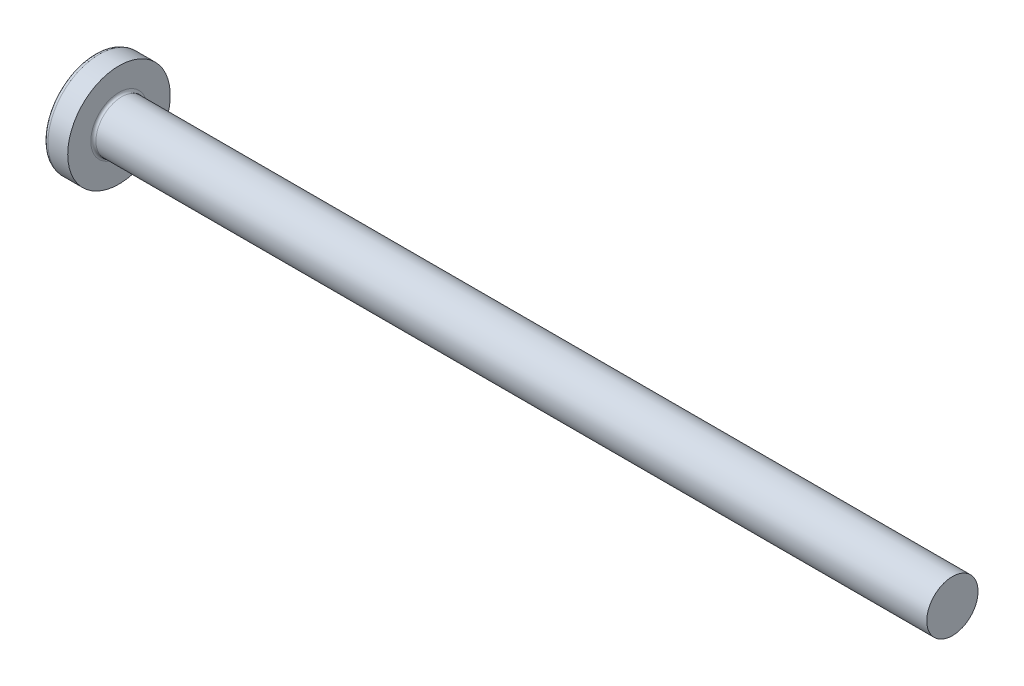
ISO-10303-21;
HEADER;
FILE_DESCRIPTION(('STEP AP214'),'2;1');
FILE_NAME('part.step','',(''),(''),'','','');
FILE_SCHEMA(('AUTOMOTIVE_DESIGN { 1 0 10303 214 1 1 1 1 }'));
ENDSEC;
DATA;
#1=APPLICATION_CONTEXT('core data for automotive mechanical design processes');
#2=APPLICATION_PROTOCOL_DEFINITION('international standard','automotive_design',2000,#1);
#3=PRODUCT_CONTEXT('',#1,'mechanical');
#4=PRODUCT('Part','Part','',(#3));
#5=PRODUCT_RELATED_PRODUCT_CATEGORY('part','',(#4));
#6=PRODUCT_DEFINITION_FORMATION('','',#4);
#7=PRODUCT_DEFINITION_CONTEXT('part definition',#1,'design');
#8=PRODUCT_DEFINITION('design','',#6,#7);
#9=PRODUCT_DEFINITION_SHAPE('','',#8);
#10=(LENGTH_UNIT() NAMED_UNIT(*) SI_UNIT(.MILLI.,.METRE.));
#11=(NAMED_UNIT(*) PLANE_ANGLE_UNIT() SI_UNIT($,.RADIAN.));
#12=(NAMED_UNIT(*) SI_UNIT($,.STERADIAN.) SOLID_ANGLE_UNIT());
#13=UNCERTAINTY_MEASURE_WITH_UNIT(LENGTH_MEASURE(1.E-05),#10,'distance_accuracy_value','');
#14=(GEOMETRIC_REPRESENTATION_CONTEXT(3) GLOBAL_UNCERTAINTY_ASSIGNED_CONTEXT((#13)) GLOBAL_UNIT_ASSIGNED_CONTEXT((#10,
#11,#12)) REPRESENTATION_CONTEXT('',''));
#15=CARTESIAN_POINT('',(0.,0.,0.));
#16=DIRECTION('',(0.,0.,1.));
#17=DIRECTION('',(1.,0.,0.));
#18=AXIS2_PLACEMENT_3D('',#15,#16,#17);
#19=CARTESIAN_POINT('',(6.5,0.,0.));
#20=DIRECTION('',(-1.,0.,0.));
#21=DIRECTION('',(0.,1.,0.));
#22=AXIS2_PLACEMENT_3D('',#19,#20,#21);
#23=SPHERICAL_SURFACE('',#22,6.5);
#24=CARTESIAN_POINT('',(1.26538895452803,0.,0.));
#25=DIRECTION('',(-1.,0.,0.));
#26=DIRECTION('',(0.,0.,1.));
#27=AXIS2_PLACEMENT_3D('',#24,#25,#26);
#28=CIRCLE('',#27,3.85342019543974);
#29=CARTESIAN_POINT('',(1.26538895452803,0.,3.85342019543974));
#30=VERTEX_POINT('',#29);
#31=EDGE_CURVE('E222',#30,#30,#28,.T.);
#32=ORIENTED_EDGE('',*,*,#31,.T.);
#33=EDGE_LOOP('',(#32));
#34=FACE_BOUND('',#33,.T.);
#35=CARTESIAN_POINT('',(0.0788099820016241,0.,0.));
#36=DIRECTION('',(1.,0.,0.));
#37=DIRECTION('',(0.,0.,-1.));
#38=AXIS2_PLACEMENT_3D('',#35,#36,#37);
#39=CIRCLE('',#38,1.0091178091571);
#40=CARTESIAN_POINT('',(0.0788099820016233,-0.514999999999997,-0.867809744562728));
#41=VERTEX_POINT('',#40);
#42=CARTESIAN_POINT('',(0.0788099820016245,-0.867809744562729,-0.515));
#43=VERTEX_POINT('',#42);
#44=EDGE_CURVE('E381',#41,#43,#39,.F.);
#45=ORIENTED_EDGE('',*,*,#44,.F.);
#46=CARTESIAN_POINT('',(6.5,-0.515,0.));
#47=DIRECTION('',(0.,1.,0.));
#48=DIRECTION('',(0.,0.,1.));
#49=AXIS2_PLACEMENT_3D('',#46,#47,#48);
#50=CIRCLE('',#49,6.47956595768575);
#51=CARTESIAN_POINT('',(0.331830520157853,-0.514999999999993,-1.98455543332603));
#52=VERTEX_POINT('',#51);
#53=EDGE_CURVE('E297',#52,#41,#50,.T.);
#54=ORIENTED_EDGE('',*,*,#53,.F.);
#55=CARTESIAN_POINT('',(6.06443225879603,0.,0.873613881878153));
#56=DIRECTION('',(0.446197753347436,0.,-0.894934391398443));
#57=DIRECTION('',(-0.894934391398442,0.,-0.446197753347436));
#58=AXIS2_PLACEMENT_3D('',#55,#56,#57);
#59=CIRCLE('',#58,6.42628038045433);
#60=CARTESIAN_POINT('',(0.331830520157853,0.515000000000007,-1.98455543332603));
#61=VERTEX_POINT('',#60);
#62=EDGE_CURVE('E266',#52,#61,#59,.T.);
#63=ORIENTED_EDGE('',*,*,#62,.T.);
#64=CARTESIAN_POINT('',(6.5,0.515,0.));
#65=DIRECTION('',(0.,-1.,0.));
#66=DIRECTION('',(0.,0.,-1.));
#67=AXIS2_PLACEMENT_3D('',#64,#65,#66);
#68=CIRCLE('',#67,6.47956595768575);
#69=CARTESIAN_POINT('',(0.0788099820016234,0.515000000000003,-0.867809744562724));
#70=VERTEX_POINT('',#69);
#71=EDGE_CURVE('E333',#70,#61,#68,.T.);
#72=ORIENTED_EDGE('',*,*,#71,.F.);
#73=CARTESIAN_POINT('',(0.0788099820016245,0.86780974456273,-0.515));
#74=VERTEX_POINT('',#73);
#75=EDGE_CURVE('E402',#74,#70,#39,.F.);
#76=ORIENTED_EDGE('',*,*,#75,.F.);
#77=CARTESIAN_POINT('',(6.5,0.,-0.515));
#78=DIRECTION('',(0.,0.,1.));
#79=DIRECTION('',(1.,0.,0.));
#80=AXIS2_PLACEMENT_3D('',#77,#78,#79);
#81=CIRCLE('',#80,6.47956595768575);
#82=CARTESIAN_POINT('',(0.331830520157854,1.98455543332603,-0.515));
#83=VERTEX_POINT('',#82);
#84=EDGE_CURVE('E258',#83,#74,#81,.T.);
#85=ORIENTED_EDGE('',*,*,#84,.F.);
#86=CARTESIAN_POINT('',(6.06443225879603,-0.873613881878153,0.));
#87=DIRECTION('',(0.446197753347436,0.894934391398443,0.));
#88=DIRECTION('',(-0.894934391398442,0.446197753347436,0.));
#89=AXIS2_PLACEMENT_3D('',#86,#87,#88);
#90=CIRCLE('',#89,6.42628038045433);
#91=CARTESIAN_POINT('',(0.331830520157854,1.98455543332603,0.515));
#92=VERTEX_POINT('',#91);
#93=EDGE_CURVE('E262',#83,#92,#90,.T.);
#94=ORIENTED_EDGE('',*,*,#93,.T.);
#95=CARTESIAN_POINT('',(6.5,0.,0.515));
#96=DIRECTION('',(0.,0.,-1.));
#97=DIRECTION('',(0.,1.,0.));
#98=AXIS2_PLACEMENT_3D('',#95,#96,#97);
#99=CIRCLE('',#98,6.47956595768575);
#100=CARTESIAN_POINT('',(0.0788099820016245,0.86780974456273,0.515));
#101=VERTEX_POINT('',#100);
#102=EDGE_CURVE('E253',#101,#92,#99,.T.);
#103=ORIENTED_EDGE('',*,*,#102,.F.);
#104=CARTESIAN_POINT('',(0.0788099820016232,0.514999999999997,0.867809744562728));
#105=VERTEX_POINT('',#104);
#106=EDGE_CURVE('E401',#105,#101,#39,.F.);
#107=ORIENTED_EDGE('',*,*,#106,.F.);
#108=CARTESIAN_POINT('',(0.331830520157854,0.514999999999993,1.98455543332604));
#109=VERTEX_POINT('',#108);
#110=EDGE_CURVE('E278',#109,#105,#68,.T.);
#111=ORIENTED_EDGE('',*,*,#110,.F.);
#112=CARTESIAN_POINT('',(6.06443225879603,0.,-0.873613881878153));
#113=DIRECTION('',(0.446197753347436,0.,0.894934391398443));
#114=DIRECTION('',(0.894934391398442,0.,-0.446197753347436));
#115=AXIS2_PLACEMENT_3D('',#112,#113,#114);
#116=CIRCLE('',#115,6.42628038045433);
#117=CARTESIAN_POINT('',(0.331830520157854,-0.515000000000007,1.98455543332603));
#118=VERTEX_POINT('',#117);
#119=EDGE_CURVE('E56',#109,#118,#116,.T.);
#120=ORIENTED_EDGE('',*,*,#119,.T.);
#121=CARTESIAN_POINT('',(0.0788099820016234,-0.515000000000003,0.867809744562724));
#122=VERTEX_POINT('',#121);
#123=EDGE_CURVE('E275',#122,#118,#50,.T.);
#124=ORIENTED_EDGE('',*,*,#123,.F.);
#125=CARTESIAN_POINT('',(0.0788099820016245,-0.867809744562729,0.515));
#126=VERTEX_POINT('',#125);
#127=EDGE_CURVE('E440',#126,#122,#39,.F.);
#128=ORIENTED_EDGE('',*,*,#127,.F.);
#129=CARTESIAN_POINT('',(0.331830520157854,-1.98455543332603,0.515));
#130=VERTEX_POINT('',#129);
#131=EDGE_CURVE('E254',#130,#126,#99,.T.);
#132=ORIENTED_EDGE('',*,*,#131,.F.);
#133=CARTESIAN_POINT('',(6.06443225879604,0.873613881878153,0.));
#134=DIRECTION('',(0.446197753347436,-0.894934391398443,0.));
#135=DIRECTION('',(0.894934391398442,0.446197753347436,0.));
#136=AXIS2_PLACEMENT_3D('',#133,#134,#135);
#137=CIRCLE('',#136,6.42628038045433);
#138=CARTESIAN_POINT('',(0.331830520157854,-1.98455543332603,-0.515));
#139=VERTEX_POINT('',#138);
#140=EDGE_CURVE('E249',#130,#139,#137,.T.);
#141=ORIENTED_EDGE('',*,*,#140,.T.);
#142=EDGE_CURVE('E71',#43,#139,#81,.T.);
#143=ORIENTED_EDGE('',*,*,#142,.F.);
#144=EDGE_LOOP('',(#45,#54,#63,#72,#76,#85,#94,#103,#107,#111,#120,#124,#128,#132,#141,#143));
#145=FACE_BOUND('',#144,.T.);
#146=ADVANCED_FACE('F41',(#34,#145),#23,.T.);
#147=CARTESIAN_POINT('',(0.,2.15,-0.515));
#148=DIRECTION('',(0.,0.,1.));
#149=DIRECTION('',(1.,0.,0.));
#150=AXIS2_PLACEMENT_3D('',#147,#148,#149);
#151=PLANE('',#150);
#152=ORIENTED_EDGE('',*,*,#84,.T.);
#153=CARTESIAN_POINT('',(-1.51195208675156,0.994972220320188,-0.515));
#154=CARTESIAN_POINT('',(-1.2040598194928,0.970722016949958,-0.515));
#155=CARTESIAN_POINT('',(-0.896180907521175,0.946299109919651,-0.515));
#156=CARTESIAN_POINT('',(-0.280449079832186,0.896981122427851,-0.515));
#157=CARTESIAN_POINT('',(0.0274038344396859,0.872086023934883,-0.515));
#158=CARTESIAN_POINT('',(0.48914673951535,0.83429553519528,-0.515));
#159=CARTESIAN_POINT('',(0.643055047553845,0.821624058404092,-0.515));
#160=CARTESIAN_POINT('',(0.950856520197139,0.796108332639504,-0.515));
#161=CARTESIAN_POINT('',(1.10474968487868,0.783264084592466,-0.515));
#162=CARTESIAN_POINT('',(1.41251352095103,0.757376569093378,-0.515));
#163=CARTESIAN_POINT('',(1.56638419296577,0.744333309065218,-0.515));
#164=CARTESIAN_POINT('',(1.87410847343335,0.718013273188896,-0.515));
#165=CARTESIAN_POINT('',(2.02796208151372,0.704736492982792,-0.515));
#166=CARTESIAN_POINT('',(2.36455311890989,0.675386943006726,-0.515));
#167=CARTESIAN_POINT('',(2.54728562293342,0.659257575640986,-0.515));
#168=CARTESIAN_POINT('',(2.91270624109256,0.626517182479888,-0.515));
#169=CARTESIAN_POINT('',(3.09539435554038,0.609906160177238,-0.515));
#170=CARTESIAN_POINT('',(3.46069832191613,0.576073027116421,-0.515));
#171=CARTESIAN_POINT('',(3.64331417870068,0.558850968932727,-0.515));
#172=CARTESIAN_POINT('',(4.00847437496567,0.523604864540037,-0.515));
#173=CARTESIAN_POINT('',(4.19101871216888,0.505580794604253,-0.515));
#174=CARTESIAN_POINT('',(4.55606208157937,0.468429191666488,-0.515));
#175=CARTESIAN_POINT('',(4.73856107358023,0.449301262281853,-0.515));
#176=CARTESIAN_POINT('',(5.10337547353419,0.409473604748924,-0.515));
#177=CARTESIAN_POINT('',(5.28569089526422,0.388774005106069,-0.515));
#178=CARTESIAN_POINT('',(5.55897278495412,0.355828287527264,-0.515));
#179=CARTESIAN_POINT('',(5.65005277419686,0.344527918782738,-0.515));
#180=CARTESIAN_POINT('',(5.83209904103608,0.321075174263031,-0.515));
#181=CARTESIAN_POINT('',(5.92306532397915,0.308922840209686,-0.515));
#182=CARTESIAN_POINT('',(6.10486078872898,0.28342733445193,-0.515));
#183=CARTESIAN_POINT('',(6.1956899229938,0.270083817601714,-0.515));
#184=CARTESIAN_POINT('',(6.33172773785679,0.248701420809951,-0.515));
#185=CARTESIAN_POINT('',(6.37704304473344,0.241345446705304,-0.515));
#186=CARTESIAN_POINT('',(6.4675722520141,0.226018953559338,-0.515));
#187=CARTESIAN_POINT('',(6.51278614568083,0.218048394864476,-0.515));
#188=CARTESIAN_POINT('',(6.55793125759549,0.209691465274944,-0.515));
#189=B_SPLINE_CURVE_WITH_KNOTS('',3,(#153,#154,#155,#156,#157,#158,#159,#160,#161,#162,#163,
#164,#165,#166,#167,#168,#169,#170,#171,#172,#173,#174,#175,#176,#177,#178,#179,#180,#181,#182,
#183,#184,#185,#186,#187,#188),.UNSPECIFIED.,.F.,.F.,(4,2,2,2,2,2,2,2,2,2,2,2,2,2,2,2,2,4),(0.,
0.926537709781721,1.85311087258339,2.31639796016285,2.77968256468771,3.24294992902055,
3.70622594801777,4.25655436065378,4.80687878359543,5.35715597005738,5.90744944680718,
6.45794177197673,7.008389135274,7.28372117336899,7.55903973750591,7.83443833587749,
7.97216007460855,8.10989070671571),.UNSPECIFIED.);
#190=CARTESIAN_POINT('',(2.34,0.677477674908923,-0.515));
#191=VERTEX_POINT('',#190);
#192=EDGE_CURVE('E425',#74,#191,#189,.T.);
#193=ORIENTED_EDGE('',*,*,#192,.T.);
#194=DIRECTION('',(0.,1.,0.));
#195=VECTOR('',#194,1.);
#196=CARTESIAN_POINT('',(2.34,-0.983319232260742,-0.515));
#197=LINE('',#196,#195);
#198=CARTESIAN_POINT('',(2.34,0.983319232260743,-0.515));
#199=VERTEX_POINT('',#198);
#200=EDGE_CURVE('E362',#191,#199,#197,.T.);
#201=ORIENTED_EDGE('',*,*,#200,.T.);
#202=DIRECTION('',(0.894934391398442,-0.446197753347436,0.));
#203=VECTOR('',#202,1.);
#204=CARTESIAN_POINT('',(0.,2.15,-0.515));
#205=LINE('',#204,#203);
#206=EDGE_CURVE('E223',#83,#199,#205,.T.);
#207=ORIENTED_EDGE('',*,*,#206,.F.);
#208=EDGE_LOOP('',(#152,#193,#201,#207));
#209=FACE_BOUND('',#208,.T.);
#210=ADVANCED_FACE('F177',(#209),#151,.T.);
#211=CARTESIAN_POINT('',(2.34,-0.983319232260742,-0.515));
#212=VERTEX_POINT('',#211);
#213=CARTESIAN_POINT('',(2.34,-0.677477674908923,-0.515));
#214=VERTEX_POINT('',#213);
#215=EDGE_CURVE('E233',#212,#214,#197,.T.);
#216=ORIENTED_EDGE('',*,*,#215,.T.);
#217=CARTESIAN_POINT('',(-1.51195208675156,-0.994972220320188,-0.515));
#218=CARTESIAN_POINT('',(-1.2040598194928,-0.970722016949958,-0.515));
#219=CARTESIAN_POINT('',(-0.896180907521175,-0.946299109919651,-0.515));
#220=CARTESIAN_POINT('',(-0.280449079832186,-0.896981122427851,-0.515));
#221=CARTESIAN_POINT('',(0.0274038344396859,-0.872086023934883,-0.515));
#222=CARTESIAN_POINT('',(0.489146739515349,-0.83429553519528,-0.515));
#223=CARTESIAN_POINT('',(0.643055047553845,-0.821624058404092,-0.515));
#224=CARTESIAN_POINT('',(0.950856520197139,-0.796108332639504,-0.515));
#225=CARTESIAN_POINT('',(1.10474968487868,-0.783264084592466,-0.515));
#226=CARTESIAN_POINT('',(1.41251352095103,-0.757376569093378,-0.515));
#227=CARTESIAN_POINT('',(1.56638419296577,-0.744333309065218,-0.515));
#228=CARTESIAN_POINT('',(1.87410847343335,-0.718013273188896,-0.515));
#229=CARTESIAN_POINT('',(2.02796208151372,-0.704736492982792,-0.515));
#230=CARTESIAN_POINT('',(2.36455311890989,-0.675386943006726,-0.515));
#231=CARTESIAN_POINT('',(2.54728562293342,-0.659257575640986,-0.515));
#232=CARTESIAN_POINT('',(2.91270624109256,-0.626517182479888,-0.515));
#233=CARTESIAN_POINT('',(3.09539435554038,-0.609906160177238,-0.515));
#234=CARTESIAN_POINT('',(3.46069832191613,-0.576073027116421,-0.515));
#235=CARTESIAN_POINT('',(3.64331417870068,-0.558850968932727,-0.515));
#236=CARTESIAN_POINT('',(4.00847437496567,-0.523604864540037,-0.515));
#237=CARTESIAN_POINT('',(4.19101871216888,-0.505580794604253,-0.515));
#238=CARTESIAN_POINT('',(4.55606208157937,-0.468429191666488,-0.515));
#239=CARTESIAN_POINT('',(4.73856107358023,-0.449301262281853,-0.515));
#240=CARTESIAN_POINT('',(5.10337547353419,-0.409473604748924,-0.515));
#241=CARTESIAN_POINT('',(5.28569089526422,-0.388774005106069,-0.515));
#242=CARTESIAN_POINT('',(5.55897278495412,-0.355828287527264,-0.515));
#243=CARTESIAN_POINT('',(5.65005277419686,-0.344527918782738,-0.515));
#244=CARTESIAN_POINT('',(5.83209904103608,-0.321075174263031,-0.515));
#245=CARTESIAN_POINT('',(5.92306532397915,-0.308922840209686,-0.515));
#246=CARTESIAN_POINT('',(6.10486078872898,-0.28342733445193,-0.515));
#247=CARTESIAN_POINT('',(6.1956899229938,-0.270083817601714,-0.515));
#248=CARTESIAN_POINT('',(6.3317277378568,-0.24870142080995,-0.515));
#249=CARTESIAN_POINT('',(6.37704304473344,-0.241345446705304,-0.515));
#250=CARTESIAN_POINT('',(6.4675722520141,-0.226018953559337,-0.515));
#251=CARTESIAN_POINT('',(6.51278614568083,-0.218048394864476,-0.515));
#252=CARTESIAN_POINT('',(6.55793125759549,-0.209691465274944,-0.515));
#253=B_SPLINE_CURVE_WITH_KNOTS('',3,(#217,#218,#219,#220,#221,#222,#223,#224,#225,#226,#227,
#228,#229,#230,#231,#232,#233,#234,#235,#236,#237,#238,#239,#240,#241,#242,#243,#244,#245,#246,
#247,#248,#249,#250,#251,#252),.UNSPECIFIED.,.F.,.F.,(4,2,2,2,2,2,2,2,2,2,2,2,2,2,2,2,2,4),(0.,
0.926537709781721,1.85311087258339,2.31639796016285,2.77968256468771,3.24294992902055,
3.70622594801777,4.25655436065378,4.80687878359543,5.35715597005738,5.90744944680718,
6.45794177197674,7.008389135274,7.28372117336899,7.55903973750591,7.83443833587749,
7.97216007460855,8.10989070671572),.UNSPECIFIED.);
#254=EDGE_CURVE('E400',#214,#43,#253,.F.);
#255=ORIENTED_EDGE('',*,*,#254,.T.);
#256=ORIENTED_EDGE('',*,*,#142,.T.);
#257=DIRECTION('',(0.894934391398442,0.446197753347436,0.));
#258=VECTOR('',#257,1.);
#259=CARTESIAN_POINT('',(0.,-2.15,-0.515));
#260=LINE('',#259,#258);
#261=EDGE_CURVE('E337',#139,#212,#260,.T.);
#262=ORIENTED_EDGE('',*,*,#261,.T.);
#263=EDGE_LOOP('',(#216,#255,#256,#262));
#264=FACE_BOUND('',#263,.T.);
#265=ADVANCED_FACE('F183',(#264),#151,.T.);
#266=CARTESIAN_POINT('',(0.,-2.15,0.515));
#267=DIRECTION('',(0.,0.,-1.));
#268=DIRECTION('',(0.,1.,0.));
#269=AXIS2_PLACEMENT_3D('',#266,#267,#268);
#270=PLANE('',#269);
#271=DIRECTION('',(0.,-1.,0.));
#272=VECTOR('',#271,1.);
#273=CARTESIAN_POINT('',(2.34,0.983319232260742,0.515));
#274=LINE('',#273,#272);
#275=CARTESIAN_POINT('',(2.34,0.983319232260743,0.515));
#276=VERTEX_POINT('',#275);
#277=CARTESIAN_POINT('',(2.34,0.677477674908923,0.515));
#278=VERTEX_POINT('',#277);
#279=EDGE_CURVE('E348',#276,#278,#274,.T.);
#280=ORIENTED_EDGE('',*,*,#279,.T.);
#281=CARTESIAN_POINT('',(-1.51195208675156,0.994972220320187,0.515));
#282=CARTESIAN_POINT('',(-1.2040598194928,0.970722016949958,0.515));
#283=CARTESIAN_POINT('',(-0.896180907521175,0.946299109919651,0.515));
#284=CARTESIAN_POINT('',(-0.280449079832187,0.896981122427851,0.515));
#285=CARTESIAN_POINT('',(0.0274038344396859,0.872086023934883,0.515));
#286=CARTESIAN_POINT('',(0.489146739515349,0.83429553519528,0.515));
#287=CARTESIAN_POINT('',(0.643055047553845,0.821624058404092,0.515));
#288=CARTESIAN_POINT('',(0.950856520197139,0.796108332639504,0.515));
#289=CARTESIAN_POINT('',(1.10474968487868,0.783264084592466,0.515));
#290=CARTESIAN_POINT('',(1.41251352095103,0.757376569093378,0.515));
#291=CARTESIAN_POINT('',(1.56638419296577,0.744333309065218,0.515));
#292=CARTESIAN_POINT('',(1.87410847343335,0.718013273188896,0.515));
#293=CARTESIAN_POINT('',(2.02796208151372,0.704736492982792,0.515));
#294=CARTESIAN_POINT('',(2.36455311890989,0.675386943006726,0.515));
#295=CARTESIAN_POINT('',(2.54728562293342,0.659257575640986,0.515));
#296=CARTESIAN_POINT('',(2.91270624109256,0.626517182479888,0.515));
#297=CARTESIAN_POINT('',(3.09539435554038,0.609906160177238,0.515));
#298=CARTESIAN_POINT('',(3.46069832191612,0.576073027116421,0.515));
#299=CARTESIAN_POINT('',(3.64331417870068,0.558850968932727,0.515));
#300=CARTESIAN_POINT('',(4.00847437496567,0.523604864540037,0.515));
#301=CARTESIAN_POINT('',(4.19101871216888,0.505580794604253,0.515));
#302=CARTESIAN_POINT('',(4.55606208157937,0.468429191666488,0.515));
#303=CARTESIAN_POINT('',(4.73856107358022,0.449301262281854,0.515));
#304=CARTESIAN_POINT('',(5.10337547353418,0.409473604748925,0.515));
#305=CARTESIAN_POINT('',(5.28569089526422,0.38877400510607,0.515));
#306=CARTESIAN_POINT('',(5.55897278495412,0.355828287527264,0.515));
#307=CARTESIAN_POINT('',(5.65005277419686,0.344527918782739,0.515));
#308=CARTESIAN_POINT('',(5.83209904103607,0.321075174263031,0.515));
#309=CARTESIAN_POINT('',(5.92306532397915,0.308922840209686,0.515));
#310=CARTESIAN_POINT('',(6.10486078872898,0.28342733445193,0.515));
#311=CARTESIAN_POINT('',(6.1956899229938,0.270083817601714,0.515));
#312=CARTESIAN_POINT('',(6.33172773785679,0.248701420809951,0.515));
#313=CARTESIAN_POINT('',(6.37704304473344,0.241345446705304,0.515));
#314=CARTESIAN_POINT('',(6.4675722520141,0.226018953559338,0.515));
#315=CARTESIAN_POINT('',(6.51278614568083,0.218048394864476,0.515));
#316=CARTESIAN_POINT('',(6.55793125759549,0.209691465274945,0.515));
#317=B_SPLINE_CURVE_WITH_KNOTS('',3,(#281,#282,#283,#284,#285,#286,#287,#288,#289,#290,#291,
#292,#293,#294,#295,#296,#297,#298,#299,#300,#301,#302,#303,#304,#305,#306,#307,#308,#309,#310,
#311,#312,#313,#314,#315,#316),.UNSPECIFIED.,.F.,.F.,(4,2,2,2,2,2,2,2,2,2,2,2,2,2,2,2,2,4),(0.,
0.926537709781721,1.85311087258339,2.31639796016285,2.77968256468771,3.24294992902055,
3.70622594801777,4.25655436065378,4.80687878359543,5.35715597005738,5.90744944680718,
6.45794177197673,7.008389135274,7.28372117336899,7.55903973750591,7.83443833587749,
7.97216007460855,8.10989070671571),.UNSPECIFIED.);
#318=EDGE_CURVE('E302',#278,#101,#317,.F.);
#319=ORIENTED_EDGE('',*,*,#318,.T.);
#320=ORIENTED_EDGE('',*,*,#102,.T.);
#321=DIRECTION('',(0.894934391398442,-0.446197753347436,0.));
#322=VECTOR('',#321,1.);
#323=CARTESIAN_POINT('',(0.,2.15,0.515));
#324=LINE('',#323,#322);
#325=EDGE_CURVE('E230',#92,#276,#324,.T.);
#326=ORIENTED_EDGE('',*,*,#325,.T.);
#327=EDGE_LOOP('',(#280,#319,#320,#326));
#328=FACE_BOUND('',#327,.T.);
#329=ADVANCED_FACE('F421',(#328),#270,.T.);
#330=ORIENTED_EDGE('',*,*,#131,.T.);
#331=CARTESIAN_POINT('',(-1.51195208675156,-0.994972220320188,0.515));
#332=CARTESIAN_POINT('',(-1.2040598194928,-0.970722016949958,0.515));
#333=CARTESIAN_POINT('',(-0.896180907521175,-0.946299109919651,0.515));
#334=CARTESIAN_POINT('',(-0.280449079832186,-0.896981122427852,0.515));
#335=CARTESIAN_POINT('',(0.0274038344396859,-0.872086023934883,0.515));
#336=CARTESIAN_POINT('',(0.48914673951535,-0.83429553519528,0.515));
#337=CARTESIAN_POINT('',(0.643055047553845,-0.821624058404092,0.515));
#338=CARTESIAN_POINT('',(0.950856520197139,-0.796108332639504,0.515));
#339=CARTESIAN_POINT('',(1.10474968487868,-0.783264084592466,0.515));
#340=CARTESIAN_POINT('',(1.41251352095103,-0.757376569093379,0.515));
#341=CARTESIAN_POINT('',(1.56638419296577,-0.744333309065218,0.515));
#342=CARTESIAN_POINT('',(1.87410847343335,-0.718013273188896,0.515));
#343=CARTESIAN_POINT('',(2.02796208151372,-0.704736492982792,0.515));
#344=CARTESIAN_POINT('',(2.36455311890989,-0.675386943006726,0.515));
#345=CARTESIAN_POINT('',(2.54728562293342,-0.659257575640986,0.515));
#346=CARTESIAN_POINT('',(2.91270624109256,-0.626517182479888,0.515));
#347=CARTESIAN_POINT('',(3.09539435554038,-0.609906160177238,0.515));
#348=CARTESIAN_POINT('',(3.46069832191613,-0.576073027116422,0.515));
#349=CARTESIAN_POINT('',(3.64331417870068,-0.558850968932728,0.515));
#350=CARTESIAN_POINT('',(4.00847437496567,-0.523604864540037,0.515));
#351=CARTESIAN_POINT('',(4.19101871216888,-0.505580794604253,0.515));
#352=CARTESIAN_POINT('',(4.55606208157937,-0.468429191666488,0.515));
#353=CARTESIAN_POINT('',(4.73856107358023,-0.449301262281854,0.515));
#354=CARTESIAN_POINT('',(5.10337547353419,-0.409473604748924,0.515));
#355=CARTESIAN_POINT('',(5.28569089526422,-0.38877400510607,0.515));
#356=CARTESIAN_POINT('',(5.55897278495412,-0.355828287527264,0.515));
#357=CARTESIAN_POINT('',(5.65005277419686,-0.344527918782739,0.515));
#358=CARTESIAN_POINT('',(5.83209904103608,-0.321075174263031,0.515));
#359=CARTESIAN_POINT('',(5.92306532397915,-0.308922840209686,0.515));
#360=CARTESIAN_POINT('',(6.10486078872898,-0.28342733445193,0.515));
#361=CARTESIAN_POINT('',(6.1956899229938,-0.270083817601714,0.515));
#362=CARTESIAN_POINT('',(6.33172773785679,-0.248701420809951,0.515));
#363=CARTESIAN_POINT('',(6.37704304473344,-0.241345446705304,0.515));
#364=CARTESIAN_POINT('',(6.4675722520141,-0.226018953559338,0.515));
#365=CARTESIAN_POINT('',(6.51278614568083,-0.218048394864477,0.515));
#366=CARTESIAN_POINT('',(6.55793125759549,-0.209691465274945,0.515));
#367=B_SPLINE_CURVE_WITH_KNOTS('',3,(#331,#332,#333,#334,#335,#336,#337,#338,#339,#340,#341,
#342,#343,#344,#345,#346,#347,#348,#349,#350,#351,#352,#353,#354,#355,#356,#357,#358,#359,#360,
#361,#362,#363,#364,#365,#366),.UNSPECIFIED.,.F.,.F.,(4,2,2,2,2,2,2,2,2,2,2,2,2,2,2,2,2,4),(0.,
0.926537709781721,1.85311087258339,2.31639796016285,2.77968256468771,3.24294992902055,
3.70622594801777,4.25655436065378,4.80687878359543,5.35715597005738,5.90744944680718,
6.45794177197673,7.008389135274,7.28372117336899,7.55903973750591,7.83443833587749,
7.97216007460855,8.10989070671571),.UNSPECIFIED.);
#368=CARTESIAN_POINT('',(2.34,-0.677477674908923,0.515));
#369=VERTEX_POINT('',#368);
#370=EDGE_CURVE('E441',#126,#369,#367,.T.);
#371=ORIENTED_EDGE('',*,*,#370,.T.);
#372=CARTESIAN_POINT('',(2.34,-0.983319232260742,0.515));
#373=VERTEX_POINT('',#372);
#374=EDGE_CURVE('E351',#369,#373,#274,.T.);
#375=ORIENTED_EDGE('',*,*,#374,.T.);
#376=DIRECTION('',(0.894934391398442,0.446197753347436,0.));
#377=VECTOR('',#376,1.);
#378=CARTESIAN_POINT('',(0.,-2.15,0.515));
#379=LINE('',#378,#377);
#380=EDGE_CURVE('E340',#130,#373,#379,.T.);
#381=ORIENTED_EDGE('',*,*,#380,.F.);
#382=EDGE_LOOP('',(#330,#371,#375,#381));
#383=FACE_BOUND('',#382,.T.);
#384=ADVANCED_FACE('F471',(#383),#270,.T.);
#385=CARTESIAN_POINT('',(2.34,0.983319232260742,-0.515));
#386=DIRECTION('',(-1.,0.,0.));
#387=DIRECTION('',(0.,0.,1.));
#388=AXIS2_PLACEMENT_3D('',#385,#386,#387);
#389=PLANE('',#388);
#390=ORIENTED_EDGE('',*,*,#374,.F.);
#391=CARTESIAN_POINT('',(2.34,0.,0.));
#392=DIRECTION('',(-1.,0.,0.));
#393=DIRECTION('',(0.,0.,1.));
#394=AXIS2_PLACEMENT_3D('',#391,#392,#393);
#395=CIRCLE('',#394,0.851);
#396=EDGE_CURVE('E393',#214,#369,#395,.T.);
#397=ORIENTED_EDGE('',*,*,#396,.F.);
#398=ORIENTED_EDGE('',*,*,#215,.F.);
#399=DIRECTION('',(0.,0.,1.));
#400=VECTOR('',#399,1.);
#401=CARTESIAN_POINT('',(2.34,-0.983319232260742,-0.515));
#402=LINE('',#401,#400);
#403=EDGE_CURVE('E344',#212,#373,#402,.T.);
#404=ORIENTED_EDGE('',*,*,#403,.T.);
#405=EDGE_LOOP('',(#390,#397,#398,#404));
#406=FACE_BOUND('',#405,.T.);
#407=ADVANCED_FACE('F464',(#406),#389,.T.);
#408=DIRECTION('',(0.,0.,-1.));
#409=VECTOR('',#408,1.);
#410=CARTESIAN_POINT('',(2.34,-0.515000000000004,0.983319232260741));
#411=LINE('',#410,#409);
#412=CARTESIAN_POINT('',(2.34,-0.514999999999998,-0.677477674908925));
#413=VERTEX_POINT('',#412);
#414=CARTESIAN_POINT('',(2.34,-0.514999999999996,-0.983319232260744));
#415=VERTEX_POINT('',#414);
#416=EDGE_CURVE('E324',#413,#415,#411,.T.);
#417=ORIENTED_EDGE('',*,*,#416,.F.);
#418=CARTESIAN_POINT('',(2.34,0.515000000000002,-0.677477674908921));
#419=VERTEX_POINT('',#418);
#420=EDGE_CURVE('E63',#419,#413,#395,.T.);
#421=ORIENTED_EDGE('',*,*,#420,.F.);
#422=DIRECTION('',(0.,0.,1.));
#423=VECTOR('',#422,1.);
#424=CARTESIAN_POINT('',(2.34,0.515000000000004,-0.983319232260741));
#425=LINE('',#424,#423);
#426=CARTESIAN_POINT('',(2.34,0.515000000000004,-0.983319232260741));
#427=VERTEX_POINT('',#426);
#428=EDGE_CURVE('E328',#427,#419,#425,.T.);
#429=ORIENTED_EDGE('',*,*,#428,.F.);
#430=DIRECTION('',(0.,-1.,0.));
#431=VECTOR('',#430,1.);
#432=CARTESIAN_POINT('',(2.34,0.515000000000004,-0.983319232260741));
#433=LINE('',#432,#431);
#434=EDGE_CURVE('E316',#427,#415,#433,.T.);
#435=ORIENTED_EDGE('',*,*,#434,.T.);
#436=EDGE_LOOP('',(#417,#421,#429,#435));
#437=FACE_BOUND('',#436,.T.);
#438=ADVANCED_FACE('F385',(#437),#389,.T.);
#439=ORIENTED_EDGE('',*,*,#200,.F.);
#440=EDGE_CURVE('E392',#278,#191,#395,.T.);
#441=ORIENTED_EDGE('',*,*,#440,.F.);
#442=ORIENTED_EDGE('',*,*,#279,.F.);
#443=DIRECTION('',(0.,0.,-1.));
#444=VECTOR('',#443,1.);
#445=CARTESIAN_POINT('',(2.34,0.983319232260742,0.515));
#446=LINE('',#445,#444);
#447=EDGE_CURVE('E352',#276,#199,#446,.T.);
#448=ORIENTED_EDGE('',*,*,#447,.T.);
#449=EDGE_LOOP('',(#439,#441,#442,#448));
#450=FACE_BOUND('',#449,.T.);
#451=ADVANCED_FACE('F465',(#450),#389,.T.);
#452=CARTESIAN_POINT('',(0.,0.514999999999993,2.15));
#453=DIRECTION('',(0.,-1.,0.));
#454=DIRECTION('',(1.,0.,0.));
#455=AXIS2_PLACEMENT_3D('',#452,#453,#454);
#456=PLANE('',#455);
#457=ORIENTED_EDGE('',*,*,#110,.T.);
#458=CARTESIAN_POINT('',(-1.51195208754038,0.514999999999997,0.994972220382299));
#459=CARTESIAN_POINT('',(-1.20405982018868,0.514999999999997,0.970722017005066));
#460=CARTESIAN_POINT('',(-0.896180908124145,0.514999999999997,0.94629910996769));
#461=CARTESIAN_POINT('',(-0.280449080249314,0.514999999999997,0.896981122461529));
#462=CARTESIAN_POINT('',(0.0274038341154839,0.514999999999997,0.872086023961266));
#463=CARTESIAN_POINT('',(0.489146739371407,0.514999999999997,0.834295535207138));
#464=CARTESIAN_POINT('',(0.643055047497244,0.514999999999997,0.821624058408798));
#465=CARTESIAN_POINT('',(0.950856520315202,0.514999999999997,0.796108332629707));
#466=CARTESIAN_POINT('',(1.10474968508407,0.514999999999997,0.783264084575319));
#467=CARTESIAN_POINT('',(1.41251352133103,0.514999999999997,0.757376569061289));
#468=CARTESIAN_POINT('',(1.56638419343305,0.514999999999997,0.744333309025536));
#469=CARTESIAN_POINT('',(1.87410847407519,0.514999999999998,0.718013273133717));
#470=CARTESIAN_POINT('',(2.02796208224283,0.514999999999998,0.704736492919711));
#471=CARTESIAN_POINT('',(2.36455311972626,0.514999999999998,0.675386942934957));
#472=CARTESIAN_POINT('',(2.5472856237498,0.514999999999998,0.65925757556857));
#473=CARTESIAN_POINT('',(2.91270624190895,0.514999999999998,0.626517182406015));
#474=CARTESIAN_POINT('',(3.09539435635676,0.514999999999998,0.609906160102556));
#475=CARTESIAN_POINT('',(3.46069832273244,0.514999999999998,0.576073027039891));
#476=CARTESIAN_POINT('',(3.64331417951694,0.514999999999998,0.558850968855158));
#477=CARTESIAN_POINT('',(4.00847437578178,0.514999999999998,0.523604864460046));
#478=CARTESIAN_POINT('',(4.1910187129849,0.514999999999998,0.505580794522878));
#479=CARTESIAN_POINT('',(4.55606208239526,0.514999999999998,0.468429191581782));
#480=CARTESIAN_POINT('',(4.73856107439606,0.514999999999999,0.4493012621952));
#481=CARTESIAN_POINT('',(5.10337547434977,0.514999999999999,0.409473604657437));
#482=CARTESIAN_POINT('',(5.28569089607961,0.514999999999999,0.388774005011696));
#483=CARTESIAN_POINT('',(5.55897278576906,0.514999999999999,0.355828287427084));
#484=CARTESIAN_POINT('',(5.65005277501166,0.514999999999999,0.344527918680371));
#485=CARTESIAN_POINT('',(5.83209904185046,0.514999999999999,0.321075174155502));
#486=CARTESIAN_POINT('',(5.92306532479326,0.514999999999999,0.308922840099183));
#487=CARTESIAN_POINT('',(6.10486078954238,0.514999999999999,0.283427334334154));
#488=CARTESIAN_POINT('',(6.19568992380676,0.514999999999999,0.270083817479639));
#489=CARTESIAN_POINT('',(6.33172773866874,0.514999999999999,0.248701420679481));
#490=CARTESIAN_POINT('',(6.377043045545,0.514999999999999,0.241345446571709));
#491=CARTESIAN_POINT('',(6.46757225282465,0.514999999999999,0.226018953418426));
#492=CARTESIAN_POINT('',(6.51278614649077,0.514999999999999,0.218048394719371));
#493=CARTESIAN_POINT('',(6.55793125840465,0.514999999999999,0.209691465124903));
#494=B_SPLINE_CURVE_WITH_KNOTS('',3,(#458,#459,#460,#461,#462,#463,#464,#465,#466,#467,#468,
#469,#470,#471,#472,#473,#474,#475,#476,#477,#478,#479,#480,#481,#482,#483,#484,#485,#486,#487,
#488,#489,#490,#491,#492,#493),.UNSPECIFIED.,.F.,.F.,(4,2,2,2,2,2,2,2,2,2,2,2,2,2,2,2,2,4),(0.,
0.926537710061278,1.85311087314258,2.31639796098494,2.77968256577269,3.24294993036838,
3.70622594962848,4.2565543622647,4.80687878520654,5.3571559716686,5.90744944841855,
6.45794177358856,7.00838913688619,7.28372117498157,7.55903973911884,7.83443833749096,
7.97216007622236,8.10989070832989),.UNSPECIFIED.);
#495=CARTESIAN_POINT('',(2.34,0.514999999999998,0.677477674908924));
#496=VERTEX_POINT('',#495);
#497=EDGE_CURVE('E494',#105,#496,#494,.T.);
#498=ORIENTED_EDGE('',*,*,#497,.T.);
#499=CARTESIAN_POINT('',(2.34,0.514999999999997,0.983319232260744));
#500=VERTEX_POINT('',#499);
#501=EDGE_CURVE('E292',#496,#500,#425,.T.);
#502=ORIENTED_EDGE('',*,*,#501,.T.);
#503=DIRECTION('',(0.894934391398442,0.,-0.446197753347436));
#504=VECTOR('',#503,1.);
#505=CARTESIAN_POINT('',(0.,0.514999999999993,2.15));
#506=LINE('',#505,#504);
#507=EDGE_CURVE('E285',#109,#500,#506,.T.);
#508=ORIENTED_EDGE('',*,*,#507,.F.);
#509=EDGE_LOOP('',(#457,#498,#502,#508));
#510=FACE_BOUND('',#509,.T.);
#511=ADVANCED_FACE('F289',(#510),#456,.T.);
#512=CARTESIAN_POINT('',(0.,-0.514999999999992,-2.15));
#513=DIRECTION('',(0.,1.,0.));
#514=DIRECTION('',(0.,0.,1.));
#515=AXIS2_PLACEMENT_3D('',#512,#513,#514);
#516=PLANE('',#515);
#517=CARTESIAN_POINT('',(2.34,-0.515000000000004,0.983319232260741));
#518=VERTEX_POINT('',#517);
#519=CARTESIAN_POINT('',(2.34,-0.515000000000003,0.677477674908921));
#520=VERTEX_POINT('',#519);
#521=EDGE_CURVE('E320',#518,#520,#411,.T.);
#522=ORIENTED_EDGE('',*,*,#521,.T.);
#523=CARTESIAN_POINT('',(-1.51195208754038,-0.515000000000004,0.994972220382296));
#524=CARTESIAN_POINT('',(-1.20405982018868,-0.515000000000004,0.970722017005062));
#525=CARTESIAN_POINT('',(-0.896180908124145,-0.515000000000004,0.946299109967687));
#526=CARTESIAN_POINT('',(-0.280449080249314,-0.515000000000003,0.896981122461525));
#527=CARTESIAN_POINT('',(0.0274038341154835,-0.515000000000003,0.872086023961263));
#528=CARTESIAN_POINT('',(0.489146739371407,-0.515000000000003,0.834295535207134));
#529=CARTESIAN_POINT('',(0.643055047497243,-0.515000000000003,0.821624058408794));
#530=CARTESIAN_POINT('',(0.950856520315202,-0.515000000000003,0.796108332629704));
#531=CARTESIAN_POINT('',(1.10474968508407,-0.515000000000003,0.783264084575316));
#532=CARTESIAN_POINT('',(1.41251352133103,-0.515000000000003,0.757376569061286));
#533=CARTESIAN_POINT('',(1.56638419343305,-0.515000000000003,0.744333309025532));
#534=CARTESIAN_POINT('',(1.87410847407519,-0.515000000000003,0.718013273133714));
#535=CARTESIAN_POINT('',(2.02796208224282,-0.515000000000003,0.704736492919708));
#536=CARTESIAN_POINT('',(2.36455311972626,-0.515000000000002,0.675386942934954));
#537=CARTESIAN_POINT('',(2.5472856237498,-0.515000000000002,0.659257575568566));
#538=CARTESIAN_POINT('',(2.91270624190895,-0.515000000000002,0.626517182406012));
#539=CARTESIAN_POINT('',(3.09539435635676,-0.515000000000002,0.609906160102553));
#540=CARTESIAN_POINT('',(3.46069832273244,-0.515000000000002,0.576073027039887));
#541=CARTESIAN_POINT('',(3.64331417951694,-0.515000000000002,0.558850968855155));
#542=CARTESIAN_POINT('',(4.00847437578178,-0.515000000000002,0.523604864460042));
#543=CARTESIAN_POINT('',(4.1910187129849,-0.515000000000002,0.505580794522874));
#544=CARTESIAN_POINT('',(4.55606208239526,-0.515000000000002,0.468429191581778));
#545=CARTESIAN_POINT('',(4.73856107439606,-0.515000000000002,0.449301262195196));
#546=CARTESIAN_POINT('',(5.10337547434977,-0.515000000000001,0.409473604657433));
#547=CARTESIAN_POINT('',(5.28569089607961,-0.515000000000001,0.388774005011693));
#548=CARTESIAN_POINT('',(5.55897278576906,-0.515000000000001,0.355828287427081));
#549=CARTESIAN_POINT('',(5.65005277501166,-0.515000000000001,0.344527918680367));
#550=CARTESIAN_POINT('',(5.83209904185046,-0.515000000000001,0.321075174155498));
#551=CARTESIAN_POINT('',(5.92306532479326,-0.515000000000001,0.308922840099179));
#552=CARTESIAN_POINT('',(6.10486078954238,-0.515000000000001,0.283427334334151));
#553=CARTESIAN_POINT('',(6.19568992380676,-0.515000000000001,0.270083817479636));
#554=CARTESIAN_POINT('',(6.33172773866873,-0.515000000000001,0.248701420679478));
#555=CARTESIAN_POINT('',(6.37704304554499,-0.515000000000001,0.241345446571706));
#556=CARTESIAN_POINT('',(6.46757225282465,-0.515000000000001,0.226018953418422));
#557=CARTESIAN_POINT('',(6.51278614649077,-0.515000000000001,0.218048394719367));
#558=CARTESIAN_POINT('',(6.55793125840465,-0.515000000000001,0.2096914651249));
#559=B_SPLINE_CURVE_WITH_KNOTS('',3,(#523,#524,#525,#526,#527,#528,#529,#530,#531,#532,#533,
#534,#535,#536,#537,#538,#539,#540,#541,#542,#543,#544,#545,#546,#547,#548,#549,#550,#551,#552,
#553,#554,#555,#556,#557,#558),.UNSPECIFIED.,.F.,.F.,(4,2,2,2,2,2,2,2,2,2,2,2,2,2,2,2,2,4),(0.,
0.926537710061278,1.85311087314258,2.31639796098494,2.77968256577269,3.24294993036838,
3.70622594962848,4.2565543622647,4.80687878520654,5.3571559716686,5.90744944841855,
6.45794177358856,7.00838913688619,7.28372117498157,7.55903973911884,7.83443833749096,
7.97216007622236,8.10989070832989),.UNSPECIFIED.);
#560=EDGE_CURVE('E432',#520,#122,#559,.F.);
#561=ORIENTED_EDGE('',*,*,#560,.T.);
#562=ORIENTED_EDGE('',*,*,#123,.T.);
#563=DIRECTION('',(0.894934391398442,0.,-0.446197753347436));
#564=VECTOR('',#563,1.);
#565=CARTESIAN_POINT('',(0.,-0.515000000000008,2.15));
#566=LINE('',#565,#564);
#567=EDGE_CURVE('E287',#118,#518,#566,.T.);
#568=ORIENTED_EDGE('',*,*,#567,.T.);
#569=EDGE_LOOP('',(#522,#561,#562,#568));
#570=FACE_BOUND('',#569,.T.);
#571=ADVANCED_FACE('F212',(#570),#516,.T.);
#572=ORIENTED_EDGE('',*,*,#428,.T.);
#573=CARTESIAN_POINT('',(-1.51195208754038,0.515000000000004,-0.994972220382296));
#574=CARTESIAN_POINT('',(-1.20405982018868,0.515000000000003,-0.970722017005062));
#575=CARTESIAN_POINT('',(-0.896180908124145,0.515000000000003,-0.946299109967687));
#576=CARTESIAN_POINT('',(-0.280449080249314,0.515000000000003,-0.896981122461525));
#577=CARTESIAN_POINT('',(0.0274038341154835,0.515000000000003,-0.872086023961263));
#578=CARTESIAN_POINT('',(0.489146739371407,0.515000000000003,-0.834295535207134));
#579=CARTESIAN_POINT('',(0.643055047497243,0.515000000000003,-0.821624058408794));
#580=CARTESIAN_POINT('',(0.950856520315202,0.515000000000003,-0.796108332629704));
#581=CARTESIAN_POINT('',(1.10474968508407,0.515000000000003,-0.783264084575316));
#582=CARTESIAN_POINT('',(1.41251352133103,0.515000000000003,-0.757376569061286));
#583=CARTESIAN_POINT('',(1.56638419343305,0.515000000000003,-0.744333309025532));
#584=CARTESIAN_POINT('',(1.87410847407519,0.515000000000003,-0.718013273133714));
#585=CARTESIAN_POINT('',(2.02796208224282,0.515000000000002,-0.704736492919708));
#586=CARTESIAN_POINT('',(2.36455311972626,0.515000000000002,-0.675386942934954));
#587=CARTESIAN_POINT('',(2.5472856237498,0.515000000000002,-0.659257575568566));
#588=CARTESIAN_POINT('',(2.91270624190895,0.515000000000002,-0.626517182406012));
#589=CARTESIAN_POINT('',(3.09539435635676,0.515000000000002,-0.609906160102553));
#590=CARTESIAN_POINT('',(3.46069832273244,0.515000000000002,-0.576073027039887));
#591=CARTESIAN_POINT('',(3.64331417951694,0.515000000000002,-0.558850968855155));
#592=CARTESIAN_POINT('',(4.00847437578178,0.515000000000002,-0.523604864460042));
#593=CARTESIAN_POINT('',(4.1910187129849,0.515000000000002,-0.505580794522874));
#594=CARTESIAN_POINT('',(4.55606208239526,0.515000000000002,-0.468429191581778));
#595=CARTESIAN_POINT('',(4.73856107439606,0.515000000000002,-0.449301262195196));
#596=CARTESIAN_POINT('',(5.10337547434977,0.515000000000001,-0.409473604657433));
#597=CARTESIAN_POINT('',(5.28569089607961,0.515000000000001,-0.388774005011693));
#598=CARTESIAN_POINT('',(5.55897278576906,0.515000000000001,-0.355828287427081));
#599=CARTESIAN_POINT('',(5.65005277501166,0.515000000000001,-0.344527918680367));
#600=CARTESIAN_POINT('',(5.83209904185046,0.515000000000001,-0.321075174155498));
#601=CARTESIAN_POINT('',(5.92306532479326,0.515000000000001,-0.308922840099179));
#602=CARTESIAN_POINT('',(6.10486078954238,0.515000000000001,-0.283427334334151));
#603=CARTESIAN_POINT('',(6.19568992380676,0.515000000000001,-0.270083817479636));
#604=CARTESIAN_POINT('',(6.33172773866873,0.515000000000001,-0.248701420679477));
#605=CARTESIAN_POINT('',(6.37704304554499,0.515000000000001,-0.241345446571706));
#606=CARTESIAN_POINT('',(6.46757225282465,0.515000000000001,-0.226018953418422));
#607=CARTESIAN_POINT('',(6.51278614649077,0.515000000000001,-0.218048394719367));
#608=CARTESIAN_POINT('',(6.55793125840465,0.515000000000001,-0.2096914651249));
#609=B_SPLINE_CURVE_WITH_KNOTS('',3,(#573,#574,#575,#576,#577,#578,#579,#580,#581,#582,#583,
#584,#585,#586,#587,#588,#589,#590,#591,#592,#593,#594,#595,#596,#597,#598,#599,#600,#601,#602,
#603,#604,#605,#606,#607,#608),.UNSPECIFIED.,.F.,.F.,(4,2,2,2,2,2,2,2,2,2,2,2,2,2,2,2,2,4),(0.,
0.926537710061278,1.85311087314258,2.31639796098494,2.77968256577269,3.24294993036838,
3.70622594962848,4.2565543622647,4.80687878520654,5.3571559716686,5.90744944841855,
6.45794177358856,7.00838913688619,7.28372117498157,7.55903973911884,7.83443833749096,
7.97216007622236,8.10989070832989),.UNSPECIFIED.);
#610=EDGE_CURVE('E373',#419,#70,#609,.F.);
#611=ORIENTED_EDGE('',*,*,#610,.T.);
#612=ORIENTED_EDGE('',*,*,#71,.T.);
#613=DIRECTION('',(0.894934391398442,0.,0.446197753347436));
#614=VECTOR('',#613,1.);
#615=CARTESIAN_POINT('',(0.,0.515000000000008,-2.15));
#616=LINE('',#615,#614);
#617=EDGE_CURVE('E299',#61,#427,#616,.T.);
#618=ORIENTED_EDGE('',*,*,#617,.T.);
#619=EDGE_LOOP('',(#572,#611,#612,#618));
#620=FACE_BOUND('',#619,.T.);
#621=ADVANCED_FACE('F210',(#620),#456,.T.);
#622=ORIENTED_EDGE('',*,*,#53,.T.);
#623=CARTESIAN_POINT('',(-1.51195208675156,-0.514999999999996,-0.994972220320189));
#624=CARTESIAN_POINT('',(-1.2040598194928,-0.514999999999997,-0.97072201694996));
#625=CARTESIAN_POINT('',(-0.896180907521175,-0.514999999999997,-0.946299109919653));
#626=CARTESIAN_POINT('',(-0.280449079832186,-0.514999999999997,-0.896981122427853));
#627=CARTESIAN_POINT('',(0.027403834439686,-0.514999999999997,-0.872086023934885));
#628=CARTESIAN_POINT('',(0.48914673951535,-0.514999999999997,-0.834295535195282));
#629=CARTESIAN_POINT('',(0.643055047553845,-0.514999999999997,-0.821624058404094));
#630=CARTESIAN_POINT('',(0.95085652019714,-0.514999999999997,-0.796108332639506));
#631=CARTESIAN_POINT('',(1.10474968487868,-0.514999999999997,-0.783264084592467));
#632=CARTESIAN_POINT('',(1.41251352095103,-0.514999999999997,-0.75737656909338));
#633=CARTESIAN_POINT('',(1.56638419296577,-0.514999999999997,-0.74433330906522));
#634=CARTESIAN_POINT('',(1.87410847343335,-0.514999999999997,-0.718013273188898));
#635=CARTESIAN_POINT('',(2.02796208151372,-0.514999999999997,-0.704736492982794));
#636=CARTESIAN_POINT('',(2.36455311890989,-0.514999999999998,-0.675386943006728));
#637=CARTESIAN_POINT('',(2.54728562293342,-0.514999999999998,-0.659257575640988));
#638=CARTESIAN_POINT('',(2.91270624109256,-0.514999999999998,-0.62651718247989));
#639=CARTESIAN_POINT('',(3.09539435554038,-0.514999999999998,-0.60990616017724));
#640=CARTESIAN_POINT('',(3.46069832191613,-0.514999999999998,-0.576073027116423));
#641=CARTESIAN_POINT('',(3.64331417870068,-0.514999999999998,-0.558850968932729));
#642=CARTESIAN_POINT('',(4.00847437496567,-0.514999999999998,-0.523604864540039));
#643=CARTESIAN_POINT('',(4.19101871216888,-0.514999999999998,-0.505580794604255));
#644=CARTESIAN_POINT('',(4.55606208157937,-0.514999999999998,-0.46842919166649));
#645=CARTESIAN_POINT('',(4.73856107358023,-0.514999999999998,-0.449301262281856));
#646=CARTESIAN_POINT('',(5.10337547353419,-0.514999999999999,-0.409473604748926));
#647=CARTESIAN_POINT('',(5.28569089526422,-0.514999999999999,-0.388774005106071));
#648=CARTESIAN_POINT('',(5.55897278495412,-0.514999999999999,-0.355828287527266));
#649=CARTESIAN_POINT('',(5.65005277419686,-0.514999999999999,-0.34452791878274));
#650=CARTESIAN_POINT('',(5.83209904103608,-0.514999999999999,-0.321075174263033));
#651=CARTESIAN_POINT('',(5.92306532397915,-0.514999999999999,-0.308922840209688));
#652=CARTESIAN_POINT('',(6.10486078872898,-0.514999999999999,-0.283427334451932));
#653=CARTESIAN_POINT('',(6.1956899229938,-0.514999999999999,-0.270083817601717));
#654=CARTESIAN_POINT('',(6.33172773785679,-0.514999999999999,-0.248701420809953));
#655=CARTESIAN_POINT('',(6.37704304473344,-0.514999999999999,-0.241345446705306));
#656=CARTESIAN_POINT('',(6.4675722520141,-0.514999999999999,-0.22601895355934));
#657=CARTESIAN_POINT('',(6.51278614568083,-0.514999999999999,-0.218048394864478));
#658=CARTESIAN_POINT('',(6.55793125759549,-0.514999999999999,-0.209691465274947));
#659=B_SPLINE_CURVE_WITH_KNOTS('',3,(#623,#624,#625,#626,#627,#628,#629,#630,#631,#632,#633,
#634,#635,#636,#637,#638,#639,#640,#641,#642,#643,#644,#645,#646,#647,#648,#649,#650,#651,#652,
#653,#654,#655,#656,#657,#658),.UNSPECIFIED.,.F.,.F.,(4,2,2,2,2,2,2,2,2,2,2,2,2,2,2,2,2,4),(0.,
0.926537709781721,1.85311087258339,2.31639796016285,2.77968256468771,3.24294992902054,
3.70622594801777,4.25655436065378,4.80687878359543,5.35715597005738,5.90744944680718,
6.45794177197673,7.008389135274,7.28372117336899,7.55903973750591,7.83443833587749,
7.97216007460855,8.10989070671571),.UNSPECIFIED.);
#660=EDGE_CURVE('E11',#41,#413,#659,.T.);
#661=ORIENTED_EDGE('',*,*,#660,.T.);
#662=ORIENTED_EDGE('',*,*,#416,.T.);
#663=DIRECTION('',(0.894934391398442,0.,0.446197753347436));
#664=VECTOR('',#663,1.);
#665=CARTESIAN_POINT('',(0.,-0.514999999999992,-2.15));
#666=LINE('',#665,#664);
#667=EDGE_CURVE('E312',#52,#415,#666,.T.);
#668=ORIENTED_EDGE('',*,*,#667,.F.);
#669=EDGE_LOOP('',(#622,#661,#662,#668));
#670=FACE_BOUND('',#669,.T.);
#671=ADVANCED_FACE('F205',(#670),#516,.T.);
#672=CARTESIAN_POINT('',(-25.4,0.,0.));
#673=DIRECTION('',(-1.,0.,0.));
#674=DIRECTION('',(0.,0.,1.));
#675=AXIS2_PLACEMENT_3D('',#672,#673,#674);
#676=CYLINDRICAL_SURFACE('',#675,2.);
#677=CARTESIAN_POINT('',(3.3,0.,0.));
#678=DIRECTION('',(-1.,0.,0.));
#679=DIRECTION('',(0.,0.,1.));
#680=AXIS2_PLACEMENT_3D('',#677,#678,#679);
#681=CIRCLE('',#680,2.);
#682=CARTESIAN_POINT('',(3.3,0.,2.));
#683=VERTEX_POINT('',#682);
#684=EDGE_CURVE('E216',#683,#683,#681,.F.);
#685=ORIENTED_EDGE('',*,*,#684,.T.);
#686=EDGE_LOOP('',(#685));
#687=FACE_BOUND('',#686,.T.);
#688=CARTESIAN_POINT('',(68.1,0.,0.));
#689=DIRECTION('',(-1.,0.,0.));
#690=DIRECTION('',(0.,0.,1.));
#691=AXIS2_PLACEMENT_3D('',#688,#689,#690);
#692=CIRCLE('',#691,2.);
#693=CARTESIAN_POINT('',(68.1,0.,2.));
#694=VERTEX_POINT('',#693);
#695=EDGE_CURVE('E219',#694,#694,#692,.T.);
#696=ORIENTED_EDGE('',*,*,#695,.T.);
#697=EDGE_LOOP('',(#696));
#698=FACE_BOUND('',#697,.T.);
#699=ADVANCED_FACE('F202',(#687,#698),#676,.T.);
#700=CARTESIAN_POINT('',(3.1,2.,0.));
#701=DIRECTION('',(-1.,0.,0.));
#702=DIRECTION('',(0.,0.,1.));
#703=AXIS2_PLACEMENT_3D('',#700,#701,#702);
#704=PLANE('',#703);
#705=CARTESIAN_POINT('',(3.1,0.,0.));
#706=DIRECTION('',(-1.,0.,0.));
#707=DIRECTION('',(0.,0.,1.));
#708=AXIS2_PLACEMENT_3D('',#705,#706,#707);
#709=CIRCLE('',#708,2.2);
#710=CARTESIAN_POINT('',(3.1,0.,2.2));
#711=VERTEX_POINT('',#710);
#712=EDGE_CURVE('E243',#711,#711,#709,.T.);
#713=ORIENTED_EDGE('',*,*,#712,.T.);
#714=EDGE_LOOP('',(#713));
#715=FACE_BOUND('',#714,.T.);
#716=CARTESIAN_POINT('',(3.1,0.,0.));
#717=DIRECTION('',(-1.,0.,0.));
#718=DIRECTION('',(0.,0.,1.));
#719=AXIS2_PLACEMENT_3D('',#716,#717,#718);
#720=CIRCLE('',#719,4.);
#721=CARTESIAN_POINT('',(3.1,0.,4.));
#722=VERTEX_POINT('',#721);
#723=EDGE_CURVE('E239',#722,#722,#720,.T.);
#724=ORIENTED_EDGE('',*,*,#723,.F.);
#725=EDGE_LOOP('',(#724));
#726=FACE_BOUND('',#725,.T.);
#727=ADVANCED_FACE('F199',(#715,#726),#704,.F.);
#728=CARTESIAN_POINT('',(-25.4,0.,0.));
#729=DIRECTION('',(-1.,0.,0.));
#730=DIRECTION('',(0.,0.,1.));
#731=AXIS2_PLACEMENT_3D('',#728,#729,#730);
#732=CYLINDRICAL_SURFACE('',#731,4.);
#733=ORIENTED_EDGE('',*,*,#723,.T.);
#734=EDGE_LOOP('',(#733));
#735=FACE_BOUND('',#734,.T.);
#736=CARTESIAN_POINT('',(1.55530587396955,0.,0.));
#737=DIRECTION('',(-1.,0.,0.));
#738=DIRECTION('',(0.,0.,1.));
#739=AXIS2_PLACEMENT_3D('',#736,#737,#738);
#740=CIRCLE('',#739,4.);
#741=CARTESIAN_POINT('',(1.55530587396955,0.,4.));
#742=VERTEX_POINT('',#741);
#743=EDGE_CURVE('E227',#742,#742,#740,.T.);
#744=ORIENTED_EDGE('',*,*,#743,.F.);
#745=EDGE_LOOP('',(#744));
#746=FACE_BOUND('',#745,.T.);
#747=ADVANCED_FACE('F195',(#735,#746),#732,.T.);
#748=CARTESIAN_POINT('',(1.55530587396955,0.,0.));
#749=DIRECTION('',(-1.,0.,0.));
#750=DIRECTION('',(0.,0.,1.));
#751=AXIS2_PLACEMENT_3D('',#748,#749,#750);
#752=TOROIDAL_SURFACE('',#751,3.64,0.36);
#753=ORIENTED_EDGE('',*,*,#743,.T.);
#754=EDGE_LOOP('',(#753));
#755=FACE_BOUND('',#754,.T.);
#756=ORIENTED_EDGE('',*,*,#31,.F.);
#757=EDGE_LOOP('',(#756));
#758=FACE_BOUND('',#757,.T.);
#759=ADVANCED_FACE('F192',(#755,#758),#752,.T.);
#760=CARTESIAN_POINT('',(68.1,2.,0.));
#761=DIRECTION('',(1.,0.,0.));
#762=DIRECTION('',(0.,0.,-1.));
#763=AXIS2_PLACEMENT_3D('',#760,#761,#762);
#764=PLANE('',#763);
#765=ORIENTED_EDGE('',*,*,#695,.F.);
#766=EDGE_LOOP('',(#765));
#767=FACE_BOUND('',#766,.T.);
#768=ADVANCED_FACE('F190',(#767),#764,.T.);
#769=CARTESIAN_POINT('',(3.3,0.,0.));
#770=DIRECTION('',(-1.,0.,0.));
#771=DIRECTION('',(0.,0.,1.));
#772=AXIS2_PLACEMENT_3D('',#769,#770,#771);
#773=TOROIDAL_SURFACE('',#772,2.2,0.2);
#774=ORIENTED_EDGE('',*,*,#684,.F.);
#775=EDGE_LOOP('',(#774));
#776=FACE_BOUND('',#775,.T.);
#777=ORIENTED_EDGE('',*,*,#712,.F.);
#778=EDGE_LOOP('',(#777));
#779=FACE_BOUND('',#778,.T.);
#780=ADVANCED_FACE('F43',(#776,#779),#773,.F.);
#781=CARTESIAN_POINT('',(2.34,0.983319232260742,0.515));
#782=DIRECTION('',(0.446197753347436,0.894934391398443,0.));
#783=DIRECTION('',(-0.894934391398442,0.446197753347436,0.));
#784=AXIS2_PLACEMENT_3D('',#781,#782,#783);
#785=PLANE('',#784);
#786=ORIENTED_EDGE('',*,*,#206,.T.);
#787=ORIENTED_EDGE('',*,*,#447,.F.);
#788=ORIENTED_EDGE('',*,*,#325,.F.);
#789=ORIENTED_EDGE('',*,*,#93,.F.);
#790=EDGE_LOOP('',(#786,#787,#788,#789));
#791=FACE_BOUND('',#790,.T.);
#792=ADVANCED_FACE('F419',(#791),#785,.F.);
#793=CARTESIAN_POINT('',(2.34,-0.983319232260742,-0.515));
#794=DIRECTION('',(0.446197753347436,-0.894934391398443,0.));
#795=DIRECTION('',(0.894934391398442,0.446197753347436,0.));
#796=AXIS2_PLACEMENT_3D('',#793,#794,#795);
#797=PLANE('',#796);
#798=ORIENTED_EDGE('',*,*,#380,.T.);
#799=ORIENTED_EDGE('',*,*,#403,.F.);
#800=ORIENTED_EDGE('',*,*,#261,.F.);
#801=ORIENTED_EDGE('',*,*,#140,.F.);
#802=EDGE_LOOP('',(#798,#799,#800,#801));
#803=FACE_BOUND('',#802,.T.);
#804=ADVANCED_FACE('F462',(#803),#797,.F.);
#805=ORIENTED_EDGE('',*,*,#501,.F.);
#806=EDGE_CURVE('E397',#520,#496,#395,.T.);
#807=ORIENTED_EDGE('',*,*,#806,.F.);
#808=ORIENTED_EDGE('',*,*,#521,.F.);
#809=DIRECTION('',(0.,1.,0.));
#810=VECTOR('',#809,1.);
#811=CARTESIAN_POINT('',(2.34,-0.515000000000004,0.983319232260741));
#812=LINE('',#811,#810);
#813=EDGE_CURVE('E325',#518,#500,#812,.T.);
#814=ORIENTED_EDGE('',*,*,#813,.T.);
#815=EDGE_LOOP('',(#805,#807,#808,#814));
#816=FACE_BOUND('',#815,.T.);
#817=ADVANCED_FACE('F458',(#816),#389,.T.);
#818=CARTESIAN_POINT('',(2.34,-0.515000000000004,0.983319232260741));
#819=DIRECTION('',(0.446197753347436,0.,0.894934391398443));
#820=DIRECTION('',(-0.894934391398442,0.,0.446197753347436));
#821=AXIS2_PLACEMENT_3D('',#818,#819,#820);
#822=PLANE('',#821);
#823=ORIENTED_EDGE('',*,*,#507,.T.);
#824=ORIENTED_EDGE('',*,*,#813,.F.);
#825=ORIENTED_EDGE('',*,*,#567,.F.);
#826=ORIENTED_EDGE('',*,*,#119,.F.);
#827=EDGE_LOOP('',(#823,#824,#825,#826));
#828=FACE_BOUND('',#827,.T.);
#829=ADVANCED_FACE('F283',(#828),#822,.F.);
#830=CARTESIAN_POINT('',(2.34,0.515000000000004,-0.983319232260741));
#831=DIRECTION('',(0.446197753347436,0.,-0.894934391398443));
#832=DIRECTION('',(0.894934391398442,0.,0.446197753347436));
#833=AXIS2_PLACEMENT_3D('',#830,#831,#832);
#834=PLANE('',#833);
#835=ORIENTED_EDGE('',*,*,#667,.T.);
#836=ORIENTED_EDGE('',*,*,#434,.F.);
#837=ORIENTED_EDGE('',*,*,#617,.F.);
#838=ORIENTED_EDGE('',*,*,#62,.F.);
#839=EDGE_LOOP('',(#835,#836,#837,#838));
#840=FACE_BOUND('',#839,.T.);
#841=ADVANCED_FACE('F376',(#840),#834,.F.);
#842=CARTESIAN_POINT('',(2.34,0.,0.));
#843=DIRECTION('',(-1.,0.,0.));
#844=DIRECTION('',(0.,0.,1.));
#845=AXIS2_PLACEMENT_3D('',#842,#843,#844);
#846=CONICAL_SURFACE('',#845,0.851,0.0698131700797659);
#847=EDGE_CURVE('E394',#496,#278,#395,.T.);
#848=ORIENTED_EDGE('',*,*,#847,.F.);
#849=ORIENTED_EDGE('',*,*,#497,.F.);
#850=ORIENTED_EDGE('',*,*,#106,.T.);
#851=ORIENTED_EDGE('',*,*,#318,.F.);
#852=EDGE_LOOP('',(#848,#849,#850,#851));
#853=FACE_BOUND('',#852,.T.);
#854=ADVANCED_FACE('F174',(#853),#846,.F.);
#855=ORIENTED_EDGE('',*,*,#127,.T.);
#856=ORIENTED_EDGE('',*,*,#560,.F.);
#857=EDGE_CURVE('E508',#369,#520,#395,.T.);
#858=ORIENTED_EDGE('',*,*,#857,.F.);
#859=ORIENTED_EDGE('',*,*,#370,.F.);
#860=EDGE_LOOP('',(#855,#856,#858,#859));
#861=FACE_BOUND('',#860,.T.);
#862=ADVANCED_FACE('F456',(#861),#846,.F.);
#863=ORIENTED_EDGE('',*,*,#75,.T.);
#864=ORIENTED_EDGE('',*,*,#610,.F.);
#865=EDGE_CURVE('E387',#191,#419,#395,.T.);
#866=ORIENTED_EDGE('',*,*,#865,.F.);
#867=ORIENTED_EDGE('',*,*,#192,.F.);
#868=EDGE_LOOP('',(#863,#864,#866,#867));
#869=FACE_BOUND('',#868,.T.);
#870=ADVANCED_FACE('F172',(#869),#846,.F.);
#871=EDGE_CURVE('E388',#413,#214,#395,.T.);
#872=ORIENTED_EDGE('',*,*,#871,.F.);
#873=ORIENTED_EDGE('',*,*,#660,.F.);
#874=ORIENTED_EDGE('',*,*,#44,.T.);
#875=ORIENTED_EDGE('',*,*,#254,.F.);
#876=EDGE_LOOP('',(#872,#873,#874,#875));
#877=FACE_BOUND('',#876,.T.);
#878=ADVANCED_FACE('F167',(#877),#846,.F.);
#879=CARTESIAN_POINT('',(2.6165066614942,0.,0.));
#880=DIRECTION('',(-1.,0.,0.));
#881=DIRECTION('',(0.,0.,1.));
#882=AXIS2_PLACEMENT_3D('',#879,#880,#881);
#883=CONICAL_SURFACE('',#882,0.,1.25663706143592);
#884=ORIENTED_EDGE('',*,*,#847,.T.);
#885=ORIENTED_EDGE('',*,*,#440,.T.);
#886=ORIENTED_EDGE('',*,*,#865,.T.);
#887=ORIENTED_EDGE('',*,*,#420,.T.);
#888=ORIENTED_EDGE('',*,*,#871,.T.);
#889=ORIENTED_EDGE('',*,*,#396,.T.);
#890=ORIENTED_EDGE('',*,*,#857,.T.);
#891=ORIENTED_EDGE('',*,*,#806,.T.);
#892=EDGE_LOOP('',(#884,#885,#886,#887,#888,#889,#890,#891));
#893=FACE_BOUND('',#892,.T.);
#894=CARTESIAN_POINT('',(2.6165066614942,0.,0.));
#895=VERTEX_POINT('',#894);
#896=VERTEX_LOOP('',#895);
#897=FACE_BOUND('',#896,.T.);
#898=ADVANCED_FACE('F165',(#893,#897),#883,.F.);
#899=CLOSED_SHELL('',(#146,#210,#265,#329,#384,#407,#438,#451,#511,#571,#621,#671,#699,#727,
#747,#759,#768,#780,#792,#804,#817,#829,#841,#854,#862,#870,#878,#898));
#900=MANIFOLD_SOLID_BREP('B2',#899);
#901=ADVANCED_BREP_SHAPE_REPRESENTATION('',(#18,#900),#14);
#902=SHAPE_DEFINITION_REPRESENTATION(#9,#901);
ENDSEC;
END-ISO-10303-21;
